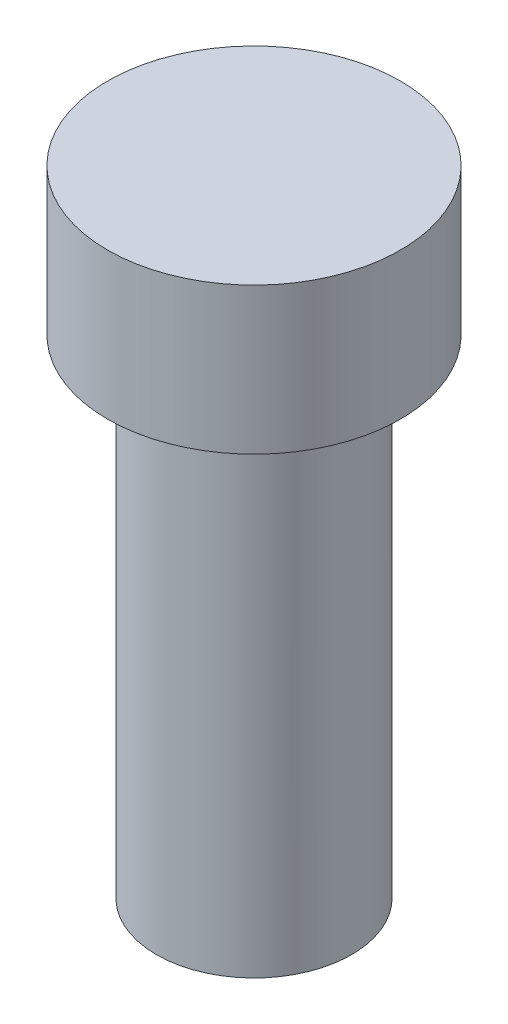
ISO-10303-21;
HEADER;
FILE_DESCRIPTION(('STEP AP214'),'2;1');
FILE_NAME('part.step','',(''),(''),'','','');
FILE_SCHEMA(('AUTOMOTIVE_DESIGN { 1 0 10303 214 1 1 1 1 }'));
ENDSEC;
DATA;
#1=APPLICATION_CONTEXT('core data for automotive mechanical design processes');
#2=APPLICATION_PROTOCOL_DEFINITION('international standard','automotive_design',2000,#1);
#3=PRODUCT_CONTEXT('',#1,'mechanical');
#4=PRODUCT('Part','Part','',(#3));
#5=PRODUCT_RELATED_PRODUCT_CATEGORY('part','',(#4));
#6=PRODUCT_DEFINITION_FORMATION('','',#4);
#7=PRODUCT_DEFINITION_CONTEXT('part definition',#1,'design');
#8=PRODUCT_DEFINITION('design','',#6,#7);
#9=PRODUCT_DEFINITION_SHAPE('','',#8);
#10=(LENGTH_UNIT() NAMED_UNIT(*) SI_UNIT(.MILLI.,.METRE.));
#11=(NAMED_UNIT(*) PLANE_ANGLE_UNIT() SI_UNIT($,.RADIAN.));
#12=(NAMED_UNIT(*) SI_UNIT($,.STERADIAN.) SOLID_ANGLE_UNIT());
#13=UNCERTAINTY_MEASURE_WITH_UNIT(LENGTH_MEASURE(1.E-05),#10,'distance_accuracy_value','');
#14=(GEOMETRIC_REPRESENTATION_CONTEXT(3) GLOBAL_UNCERTAINTY_ASSIGNED_CONTEXT((#13)) GLOBAL_UNIT_ASSIGNED_CONTEXT((#10,
#11,#12)) REPRESENTATION_CONTEXT('',''));
#15=CARTESIAN_POINT('',(0.,0.,0.));
#16=DIRECTION('',(0.,0.,1.));
#17=DIRECTION('',(1.,0.,0.));
#18=AXIS2_PLACEMENT_3D('',#15,#16,#17);
#19=CARTESIAN_POINT('',(0.,3.,0.));
#20=DIRECTION('',(0.,-1.,0.));
#21=DIRECTION('',(0.,0.,-1.));
#22=AXIS2_PLACEMENT_3D('',#19,#20,#21);
#23=CYLINDRICAL_SURFACE('',#22,3.);
#24=CARTESIAN_POINT('',(0.,3.,0.));
#25=DIRECTION('',(0.,1.,0.));
#26=DIRECTION('',(0.,0.,1.));
#27=AXIS2_PLACEMENT_3D('',#24,#25,#26);
#28=CIRCLE('',#27,3.);
#29=CARTESIAN_POINT('',(0.,3.,3.));
#30=VERTEX_POINT('',#29);
#31=EDGE_CURVE('E37',#30,#30,#28,.T.);
#32=ORIENTED_EDGE('',*,*,#31,.F.);
#33=EDGE_LOOP('',(#32));
#34=FACE_BOUND('',#33,.T.);
#35=CARTESIAN_POINT('',(0.,0.,0.));
#36=DIRECTION('',(0.,1.,0.));
#37=DIRECTION('',(0.,0.,1.));
#38=AXIS2_PLACEMENT_3D('',#35,#36,#37);
#39=CIRCLE('',#38,3.);
#40=CARTESIAN_POINT('',(0.,0.,3.));
#41=VERTEX_POINT('',#40);
#42=EDGE_CURVE('E41',#41,#41,#39,.T.);
#43=ORIENTED_EDGE('',*,*,#42,.T.);
#44=EDGE_LOOP('',(#43));
#45=FACE_BOUND('',#44,.T.);
#46=ADVANCED_FACE('F31',(#34,#45),#23,.T.);
#47=CARTESIAN_POINT('',(0.,3.,0.));
#48=DIRECTION('',(0.,1.,0.));
#49=DIRECTION('',(0.,0.,1.));
#50=AXIS2_PLACEMENT_3D('',#47,#48,#49);
#51=PLANE('',#50);
#52=ORIENTED_EDGE('',*,*,#31,.T.);
#53=EDGE_LOOP('',(#52));
#54=FACE_BOUND('',#53,.T.);
#55=ADVANCED_FACE('F62',(#54),#51,.T.);
#56=CARTESIAN_POINT('',(0.,0.,0.));
#57=DIRECTION('',(0.,1.,0.));
#58=DIRECTION('',(0.,0.,1.));
#59=AXIS2_PLACEMENT_3D('',#56,#57,#58);
#60=PLANE('',#59);
#61=CARTESIAN_POINT('',(0.,0.,0.));
#62=DIRECTION('',(0.,1.,0.));
#63=DIRECTION('',(0.,0.,1.));
#64=AXIS2_PLACEMENT_3D('',#61,#62,#63);
#65=CIRCLE('',#64,2.);
#66=CARTESIAN_POINT('',(0.,0.,2.));
#67=VERTEX_POINT('',#66);
#68=EDGE_CURVE('E10',#67,#67,#65,.F.);
#69=ORIENTED_EDGE('',*,*,#68,.F.);
#70=EDGE_LOOP('',(#69));
#71=FACE_BOUND('',#70,.T.);
#72=ORIENTED_EDGE('',*,*,#42,.F.);
#73=EDGE_LOOP('',(#72));
#74=FACE_BOUND('',#73,.T.);
#75=ADVANCED_FACE('F55',(#71,#74),#60,.F.);
#76=CARTESIAN_POINT('',(0.,-10.,0.));
#77=DIRECTION('',(0.,1.,0.));
#78=DIRECTION('',(0.,0.,1.));
#79=AXIS2_PLACEMENT_3D('',#76,#77,#78);
#80=CYLINDRICAL_SURFACE('',#79,2.);
#81=CARTESIAN_POINT('',(0.,-10.,0.));
#82=DIRECTION('',(0.,-1.,0.));
#83=DIRECTION('',(0.,0.,-1.));
#84=AXIS2_PLACEMENT_3D('',#81,#82,#83);
#85=CIRCLE('',#84,2.);
#86=CARTESIAN_POINT('',(0.,-10.,-2.));
#87=VERTEX_POINT('',#86);
#88=EDGE_CURVE('E46',#87,#87,#85,.T.);
#89=ORIENTED_EDGE('',*,*,#88,.F.);
#90=EDGE_LOOP('',(#89));
#91=FACE_BOUND('',#90,.T.);
#92=ORIENTED_EDGE('',*,*,#68,.T.);
#93=EDGE_LOOP('',(#92));
#94=FACE_BOUND('',#93,.T.);
#95=ADVANCED_FACE('F53',(#91,#94),#80,.T.);
#96=CARTESIAN_POINT('',(0.,-10.,0.));
#97=DIRECTION('',(0.,-1.,0.));
#98=DIRECTION('',(0.,0.,-1.));
#99=AXIS2_PLACEMENT_3D('',#96,#97,#98);
#100=PLANE('',#99);
#101=ORIENTED_EDGE('',*,*,#88,.T.);
#102=EDGE_LOOP('',(#101));
#103=FACE_BOUND('',#102,.T.);
#104=ADVANCED_FACE('F51',(#103),#100,.T.);
#105=CLOSED_SHELL('',(#46,#55,#75,#95,#104));
#106=MANIFOLD_SOLID_BREP('B2',#105);
#107=ADVANCED_BREP_SHAPE_REPRESENTATION('',(#18,#106),#14);
#108=SHAPE_DEFINITION_REPRESENTATION(#9,#107);
ENDSEC;
END-ISO-10303-21;
